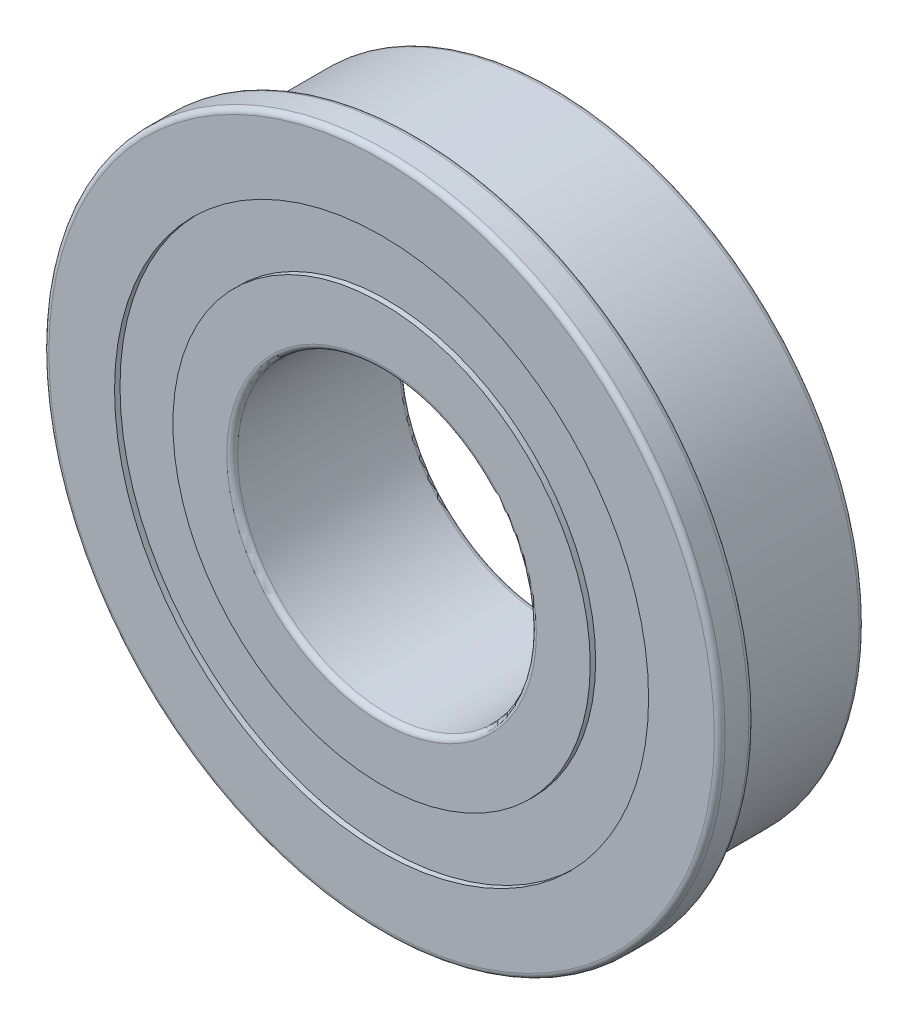
ISO-10303-21;
HEADER;
FILE_DESCRIPTION(('STEP AP214'),'2;1');
FILE_NAME('part.step','',(''),(''),'','','');
FILE_SCHEMA(('AUTOMOTIVE_DESIGN { 1 0 10303 214 1 1 1 1 }'));
ENDSEC;
DATA;
#1=APPLICATION_CONTEXT('core data for automotive mechanical design processes');
#2=APPLICATION_PROTOCOL_DEFINITION('international standard','automotive_design',2000,#1);
#3=PRODUCT_CONTEXT('',#1,'mechanical');
#4=PRODUCT('Part','Part','',(#3));
#5=PRODUCT_RELATED_PRODUCT_CATEGORY('part','',(#4));
#6=PRODUCT_DEFINITION_FORMATION('','',#4);
#7=PRODUCT_DEFINITION_CONTEXT('part definition',#1,'design');
#8=PRODUCT_DEFINITION('design','',#6,#7);
#9=PRODUCT_DEFINITION_SHAPE('','',#8);
#10=(LENGTH_UNIT() NAMED_UNIT(*) SI_UNIT(.MILLI.,.METRE.));
#11=(NAMED_UNIT(*) PLANE_ANGLE_UNIT() SI_UNIT($,.RADIAN.));
#12=(NAMED_UNIT(*) SI_UNIT($,.STERADIAN.) SOLID_ANGLE_UNIT());
#13=UNCERTAINTY_MEASURE_WITH_UNIT(LENGTH_MEASURE(1.E-05),#10,'distance_accuracy_value','');
#14=(GEOMETRIC_REPRESENTATION_CONTEXT(3) GLOBAL_UNCERTAINTY_ASSIGNED_CONTEXT((#13)) GLOBAL_UNIT_ASSIGNED_CONTEXT((#10,
#11,#12)) REPRESENTATION_CONTEXT('',''));
#15=CARTESIAN_POINT('',(0.,0.,0.));
#16=DIRECTION('',(0.,0.,1.));
#17=DIRECTION('',(1.,0.,0.));
#18=AXIS2_PLACEMENT_3D('',#15,#16,#17);
#19=CARTESIAN_POINT('',(0.,0.,53.2489151398));
#20=DIRECTION('',(0.,0.,1.));
#21=DIRECTION('',(1.,0.,0.));
#22=AXIS2_PLACEMENT_3D('',#19,#20,#21);
#23=CYLINDRICAL_SURFACE('',#22,12.2875);
#24=CARTESIAN_POINT('',(0.,0.,-3.96875));
#25=DIRECTION('',(0.,0.,1.));
#26=DIRECTION('',(1.,0.,0.));
#27=AXIS2_PLACEMENT_3D('',#24,#25,#26);
#28=CIRCLE('',#27,12.2875);
#29=CARTESIAN_POINT('',(12.2875,0.,-3.96875));
#30=VERTEX_POINT('',#29);
#31=EDGE_CURVE('E394',#30,#30,#28,.F.);
#32=ORIENTED_EDGE('',*,*,#31,.T.);
#33=EDGE_LOOP('',(#32));
#34=FACE_BOUND('',#33,.T.);
#35=CARTESIAN_POINT('',(0.,0.,-3.71875));
#36=DIRECTION('',(0.,0.,1.));
#37=DIRECTION('',(1.,0.,0.));
#38=AXIS2_PLACEMENT_3D('',#35,#36,#37);
#39=CIRCLE('',#38,12.2875);
#40=CARTESIAN_POINT('',(12.2875,0.,-3.71875));
#41=VERTEX_POINT('',#40);
#42=EDGE_CURVE('E80',#41,#41,#39,.T.);
#43=ORIENTED_EDGE('',*,*,#42,.T.);
#44=EDGE_LOOP('',(#43));
#45=FACE_BOUND('',#44,.T.);
#46=ADVANCED_FACE('F17',(#34,#45),#23,.F.);
#47=CARTESIAN_POINT('',(0.,12.2875,-3.96875));
#48=DIRECTION('',(0.,0.,1.));
#49=DIRECTION('',(1.,0.,0.));
#50=AXIS2_PLACEMENT_3D('',#47,#48,#49);
#51=PLANE('',#50);
#52=ORIENTED_EDGE('',*,*,#31,.F.);
#53=EDGE_LOOP('',(#52));
#54=FACE_BOUND('',#53,.T.);
#55=CARTESIAN_POINT('',(0.,0.,-3.96875));
#56=DIRECTION('',(0.,0.,1.));
#57=DIRECTION('',(1.,0.,0.));
#58=AXIS2_PLACEMENT_3D('',#55,#56,#57);
#59=CIRCLE('',#58,14.0375);
#60=CARTESIAN_POINT('',(14.0375,0.,-3.96875));
#61=VERTEX_POINT('',#60);
#62=CARTESIAN_POINT('',(-14.0375,0.,-3.96875));
#63=VERTEX_POINT('',#62);
#64=EDGE_CURVE('E70',#61,#63,#59,.T.);
#65=ORIENTED_EDGE('',*,*,#64,.F.);
#66=CARTESIAN_POINT('',(0.,0.,-3.96875));
#67=DIRECTION('',(0.,0.,1.));
#68=DIRECTION('',(-1.,0.,0.));
#69=AXIS2_PLACEMENT_3D('',#66,#67,#68);
#70=CIRCLE('',#69,14.0375);
#71=EDGE_CURVE('E68',#63,#61,#70,.T.);
#72=ORIENTED_EDGE('',*,*,#71,.F.);
#73=EDGE_LOOP('',(#65,#72));
#74=FACE_BOUND('',#73,.T.);
#75=ADVANCED_FACE('F79',(#54,#74),#51,.F.);
#76=CARTESIAN_POINT('',(0.,9.602,-3.71875));
#77=DIRECTION('',(0.,0.,1.));
#78=DIRECTION('',(1.,0.,0.));
#79=AXIS2_PLACEMENT_3D('',#76,#77,#78);
#80=PLANE('',#79);
#81=CARTESIAN_POINT('',(0.,0.,-3.71874999978));
#82=DIRECTION('',(0.,0.,1.));
#83=DIRECTION('',(1.,0.,0.));
#84=AXIS2_PLACEMENT_3D('',#81,#82,#83);
#85=CIRCLE('',#84,9.602);
#86=CARTESIAN_POINT('',(9.602,0.,-3.71874999978));
#87=VERTEX_POINT('',#86);
#88=EDGE_CURVE('E75',#87,#87,#85,.F.);
#89=ORIENTED_EDGE('',*,*,#88,.F.);
#90=EDGE_LOOP('',(#89));
#91=FACE_BOUND('',#90,.T.);
#92=ORIENTED_EDGE('',*,*,#42,.F.);
#93=EDGE_LOOP('',(#92));
#94=FACE_BOUND('',#93,.T.);
#95=ADVANCED_FACE('F94',(#91,#94),#80,.F.);
#96=CARTESIAN_POINT('',(0.,0.,-3.71875));
#97=DIRECTION('',(0.,0.,1.));
#98=DIRECTION('',(1.,0.,0.));
#99=AXIS2_PLACEMENT_3D('',#96,#97,#98);
#100=TOROIDAL_SURFACE('',#99,14.0375,0.25);
#101=CARTESIAN_POINT('',(0.,0.,-3.71875));
#102=DIRECTION('',(0.,0.,1.));
#103=DIRECTION('',(1.,0.,0.));
#104=AXIS2_PLACEMENT_3D('',#101,#102,#103);
#105=CIRCLE('',#104,14.2875);
#106=CARTESIAN_POINT('',(14.2875,0.,-3.71875));
#107=VERTEX_POINT('',#106);
#108=EDGE_CURVE('E109',#107,#107,#105,.T.);
#109=ORIENTED_EDGE('',*,*,#108,.F.);
#110=EDGE_LOOP('',(#109));
#111=FACE_BOUND('',#110,.T.);
#112=ORIENTED_EDGE('',*,*,#64,.T.);
#113=ORIENTED_EDGE('',*,*,#71,.T.);
#114=EDGE_LOOP('',(#112,#113));
#115=FACE_BOUND('',#114,.T.);
#116=ADVANCED_FACE('F72',(#111,#115),#100,.T.);
#117=CARTESIAN_POINT('',(0.,0.,53.2489151398));
#118=DIRECTION('',(0.,0.,1.));
#119=DIRECTION('',(1.,0.,0.));
#120=AXIS2_PLACEMENT_3D('',#117,#118,#119);
#121=CYLINDRICAL_SURFACE('',#120,9.602);
#122=ORIENTED_EDGE('',*,*,#88,.T.);
#123=EDGE_LOOP('',(#122));
#124=FACE_BOUND('',#123,.T.);
#125=CARTESIAN_POINT('',(0.,0.,-3.96874999978));
#126=DIRECTION('',(0.,0.,1.));
#127=DIRECTION('',(1.,0.,0.));
#128=AXIS2_PLACEMENT_3D('',#125,#126,#127);
#129=CIRCLE('',#128,9.602);
#130=CARTESIAN_POINT('',(9.602,0.,-3.96874999978));
#131=VERTEX_POINT('',#130);
#132=EDGE_CURVE('E112',#131,#131,#129,.T.);
#133=ORIENTED_EDGE('',*,*,#132,.T.);
#134=EDGE_LOOP('',(#133));
#135=FACE_BOUND('',#134,.T.);
#136=ADVANCED_FACE('F103',(#124,#135),#121,.T.);
#137=CARTESIAN_POINT('',(0.,0.,53.2489151398));
#138=DIRECTION('',(0.,0.,1.));
#139=DIRECTION('',(1.,0.,0.));
#140=AXIS2_PLACEMENT_3D('',#137,#138,#139);
#141=CYLINDRICAL_SURFACE('',#140,14.2875);
#142=CARTESIAN_POINT('',(0.,0.,1.63125));
#143=DIRECTION('',(0.,0.,-1.));
#144=DIRECTION('',(-1.,0.,0.));
#145=AXIS2_PLACEMENT_3D('',#142,#143,#144);
#146=CIRCLE('',#145,14.2875);
#147=CARTESIAN_POINT('',(-14.2875,0.,1.63125));
#148=VERTEX_POINT('',#147);
#149=EDGE_CURVE('E113',#148,#148,#146,.F.);
#150=ORIENTED_EDGE('',*,*,#149,.F.);
#151=EDGE_LOOP('',(#150));
#152=FACE_BOUND('',#151,.T.);
#153=ORIENTED_EDGE('',*,*,#108,.T.);
#154=EDGE_LOOP('',(#153));
#155=FACE_BOUND('',#154,.T.);
#156=ADVANCED_FACE('F163',(#152,#155),#141,.T.);
#157=CARTESIAN_POINT('',(0.,6.875,-3.96875));
#158=DIRECTION('',(0.,0.,1.));
#159=DIRECTION('',(1.,0.,0.));
#160=AXIS2_PLACEMENT_3D('',#157,#158,#159);
#161=PLANE('',#160);
#162=CARTESIAN_POINT('',(0.,0.,-3.96875));
#163=DIRECTION('',(0.,0.,-1.));
#164=DIRECTION('',(1.,0.,0.));
#165=AXIS2_PLACEMENT_3D('',#162,#163,#164);
#166=CIRCLE('',#165,7.125);
#167=CARTESIAN_POINT('',(7.125,0.,-3.96875));
#168=VERTEX_POINT('',#167);
#169=CARTESIAN_POINT('',(-7.125,0.,-3.96875));
#170=VERTEX_POINT('',#169);
#171=EDGE_CURVE('E116',#168,#170,#166,.T.);
#172=ORIENTED_EDGE('',*,*,#171,.F.);
#173=CARTESIAN_POINT('',(0.,0.,-3.96875));
#174=DIRECTION('',(0.,0.,-1.));
#175=DIRECTION('',(-1.,0.,0.));
#176=AXIS2_PLACEMENT_3D('',#173,#174,#175);
#177=CIRCLE('',#176,7.125);
#178=EDGE_CURVE('E147',#170,#168,#177,.T.);
#179=ORIENTED_EDGE('',*,*,#178,.F.);
#180=EDGE_LOOP('',(#172,#179));
#181=FACE_BOUND('',#180,.T.);
#182=ORIENTED_EDGE('',*,*,#132,.F.);
#183=EDGE_LOOP('',(#182));
#184=FACE_BOUND('',#183,.T.);
#185=ADVANCED_FACE('F155',(#181,#184),#161,.F.);
#186=CARTESIAN_POINT('',(0.,0.,1.63125));
#187=DIRECTION('',(0.,0.,-1.));
#188=DIRECTION('',(0.,1.,0.));
#189=AXIS2_PLACEMENT_3D('',#186,#187,#188);
#190=CONICAL_SURFACE('',#189,14.2875,0.523598775597999);
#191=ORIENTED_EDGE('',*,*,#149,.T.);
#192=EDGE_LOOP('',(#191));
#193=FACE_BOUND('',#192,.T.);
#194=CARTESIAN_POINT('',(0.,0.,2.00624999998003));
#195=DIRECTION('',(0.,0.,1.));
#196=DIRECTION('',(1.,0.,0.));
#197=AXIS2_PLACEMENT_3D('',#194,#195,#196);
#198=CIRCLE('',#197,14.0709936490654);
#199=CARTESIAN_POINT('',(14.0709936490654,0.,2.00624999998003));
#200=VERTEX_POINT('',#199);
#201=EDGE_CURVE('E144',#200,#200,#198,.F.);
#202=ORIENTED_EDGE('',*,*,#201,.T.);
#203=EDGE_LOOP('',(#202));
#204=FACE_BOUND('',#203,.T.);
#205=ADVANCED_FACE('F134',(#193,#204),#190,.T.);
#206=CARTESIAN_POINT('',(0.,0.,-3.71875));
#207=DIRECTION('',(0.,0.,1.));
#208=DIRECTION('',(1.,0.,0.));
#209=AXIS2_PLACEMENT_3D('',#206,#207,#208);
#210=TOROIDAL_SURFACE('',#209,7.125,0.25);
#211=ORIENTED_EDGE('',*,*,#171,.T.);
#212=ORIENTED_EDGE('',*,*,#178,.T.);
#213=EDGE_LOOP('',(#211,#212));
#214=FACE_BOUND('',#213,.T.);
#215=CARTESIAN_POINT('',(0.,0.,-3.71875));
#216=DIRECTION('',(0.,0.,1.));
#217=DIRECTION('',(1.,0.,0.));
#218=AXIS2_PLACEMENT_3D('',#215,#216,#217);
#219=CIRCLE('',#218,6.875);
#220=CARTESIAN_POINT('',(6.875,0.,-3.71875));
#221=VERTEX_POINT('',#220);
#222=EDGE_CURVE('E142',#221,#221,#219,.T.);
#223=ORIENTED_EDGE('',*,*,#222,.T.);
#224=EDGE_LOOP('',(#223));
#225=FACE_BOUND('',#224,.T.);
#226=ADVANCED_FACE('F122',(#214,#225),#210,.T.);
#227=CARTESIAN_POINT('',(0.,0.,53.2489151398));
#228=DIRECTION('',(0.,0.,1.));
#229=DIRECTION('',(1.,0.,0.));
#230=AXIS2_PLACEMENT_3D('',#227,#228,#229);
#231=CYLINDRICAL_SURFACE('',#230,6.875);
#232=ORIENTED_EDGE('',*,*,#222,.F.);
#233=EDGE_LOOP('',(#232));
#234=FACE_BOUND('',#233,.T.);
#235=CARTESIAN_POINT('',(0.,0.,3.71875));
#236=DIRECTION('',(0.,0.,-1.));
#237=DIRECTION('',(-1.,0.,0.));
#238=AXIS2_PLACEMENT_3D('',#235,#236,#237);
#239=CIRCLE('',#238,6.875);
#240=CARTESIAN_POINT('',(-6.875,0.,3.71875));
#241=VERTEX_POINT('',#240);
#242=EDGE_CURVE('E555',#241,#241,#239,.T.);
#243=ORIENTED_EDGE('',*,*,#242,.F.);
#244=EDGE_LOOP('',(#243));
#245=FACE_BOUND('',#244,.T.);
#246=ADVANCED_FACE('F133',(#234,#245),#231,.F.);
#247=CARTESIAN_POINT('',(0.,0.,2.13125));
#248=DIRECTION('',(0.,0.,1.));
#249=DIRECTION('',(1.,0.,0.));
#250=AXIS2_PLACEMENT_3D('',#247,#248,#249);
#251=TOROIDAL_SURFACE('',#250,14.2875,0.25);
#252=ORIENTED_EDGE('',*,*,#201,.F.);
#253=EDGE_LOOP('',(#252));
#254=FACE_BOUND('',#253,.T.);
#255=CARTESIAN_POINT('',(0.,0.,2.38125));
#256=DIRECTION('',(0.,0.,-1.));
#257=DIRECTION('',(1.,0.,0.));
#258=AXIS2_PLACEMENT_3D('',#255,#256,#257);
#259=CIRCLE('',#258,14.2875);
#260=CARTESIAN_POINT('',(14.2875,0.,2.38125));
#261=VERTEX_POINT('',#260);
#262=CARTESIAN_POINT('',(-14.2875,0.,2.38125));
#263=VERTEX_POINT('',#262);
#264=EDGE_CURVE('E553',#261,#263,#259,.T.);
#265=ORIENTED_EDGE('',*,*,#264,.T.);
#266=CARTESIAN_POINT('',(0.,0.,2.38125));
#267=DIRECTION('',(0.,0.,-1.));
#268=DIRECTION('',(-1.,0.,0.));
#269=AXIS2_PLACEMENT_3D('',#266,#267,#268);
#270=CIRCLE('',#269,14.2875);
#271=EDGE_CURVE('E323',#263,#261,#270,.T.);
#272=ORIENTED_EDGE('',*,*,#271,.T.);
#273=EDGE_LOOP('',(#265,#272));
#274=FACE_BOUND('',#273,.T.);
#275=ADVANCED_FACE('F356',(#254,#274),#251,.F.);
#276=CARTESIAN_POINT('',(0.,0.,3.71875));
#277=DIRECTION('',(0.,0.,-1.));
#278=DIRECTION('',(-1.,0.,0.));
#279=AXIS2_PLACEMENT_3D('',#276,#277,#278);
#280=TOROIDAL_SURFACE('',#279,7.125,0.25);
#281=CARTESIAN_POINT('',(0.,0.,3.96875));
#282=DIRECTION('',(0.,0.,1.));
#283=DIRECTION('',(-1.,0.,0.));
#284=AXIS2_PLACEMENT_3D('',#281,#282,#283);
#285=CIRCLE('',#284,7.125);
#286=CARTESIAN_POINT('',(-7.125,0.,3.96875));
#287=VERTEX_POINT('',#286);
#288=CARTESIAN_POINT('',(7.125,0.,3.96875));
#289=VERTEX_POINT('',#288);
#290=EDGE_CURVE('E267',#287,#289,#285,.T.);
#291=ORIENTED_EDGE('',*,*,#290,.T.);
#292=CARTESIAN_POINT('',(0.,0.,3.96875));
#293=DIRECTION('',(0.,0.,1.));
#294=DIRECTION('',(1.,0.,0.));
#295=AXIS2_PLACEMENT_3D('',#292,#293,#294);
#296=CIRCLE('',#295,7.125);
#297=EDGE_CURVE('E278',#289,#287,#296,.T.);
#298=ORIENTED_EDGE('',*,*,#297,.T.);
#299=EDGE_LOOP('',(#291,#298));
#300=FACE_BOUND('',#299,.T.);
#301=ORIENTED_EDGE('',*,*,#242,.T.);
#302=EDGE_LOOP('',(#301));
#303=FACE_BOUND('',#302,.T.);
#304=ADVANCED_FACE('F302',(#300,#303),#280,.T.);
#305=CARTESIAN_POINT('',(0.,14.2875,2.38125));
#306=DIRECTION('',(0.,0.,1.));
#307=DIRECTION('',(1.,0.,0.));
#308=AXIS2_PLACEMENT_3D('',#305,#306,#307);
#309=PLANE('',#308);
#310=ORIENTED_EDGE('',*,*,#264,.F.);
#311=ORIENTED_EDGE('',*,*,#271,.F.);
#312=EDGE_LOOP('',(#310,#311));
#313=FACE_BOUND('',#312,.T.);
#314=CARTESIAN_POINT('',(0.,0.,2.38125));
#315=DIRECTION('',(0.,0.,1.));
#316=DIRECTION('',(1.,0.,0.));
#317=AXIS2_PLACEMENT_3D('',#314,#315,#316);
#318=CIRCLE('',#317,15.31);
#319=CARTESIAN_POINT('',(15.31,0.,2.38125));
#320=VERTEX_POINT('',#319);
#321=CARTESIAN_POINT('',(-15.31,0.,2.38125));
#322=VERTEX_POINT('',#321);
#323=EDGE_CURVE('E236',#320,#322,#318,.T.);
#324=ORIENTED_EDGE('',*,*,#323,.F.);
#325=CARTESIAN_POINT('',(0.,0.,2.38125));
#326=DIRECTION('',(0.,0.,1.));
#327=DIRECTION('',(-1.,0.,0.));
#328=AXIS2_PLACEMENT_3D('',#325,#326,#327);
#329=CIRCLE('',#328,15.31);
#330=EDGE_CURVE('E333',#322,#320,#329,.T.);
#331=ORIENTED_EDGE('',*,*,#330,.F.);
#332=EDGE_LOOP('',(#324,#331));
#333=FACE_BOUND('',#332,.T.);
#334=ADVANCED_FACE('F293',(#313,#333),#309,.F.);
#335=CARTESIAN_POINT('',(0.,9.602,3.96875));
#336=DIRECTION('',(0.,0.,-1.));
#337=DIRECTION('',(-1.,0.,0.));
#338=AXIS2_PLACEMENT_3D('',#335,#336,#337);
#339=PLANE('',#338);
#340=ORIENTED_EDGE('',*,*,#290,.F.);
#341=ORIENTED_EDGE('',*,*,#297,.F.);
#342=EDGE_LOOP('',(#340,#341));
#343=FACE_BOUND('',#342,.T.);
#344=CARTESIAN_POINT('',(0.,0.,3.96875000022));
#345=DIRECTION('',(0.,0.,1.));
#346=DIRECTION('',(1.,0.,0.));
#347=AXIS2_PLACEMENT_3D('',#344,#345,#346);
#348=CIRCLE('',#347,9.602);
#349=CARTESIAN_POINT('',(9.602,0.,3.96875000022));
#350=VERTEX_POINT('',#349);
#351=EDGE_CURVE('E389',#350,#350,#348,.F.);
#352=ORIENTED_EDGE('',*,*,#351,.F.);
#353=EDGE_LOOP('',(#352));
#354=FACE_BOUND('',#353,.T.);
#355=ADVANCED_FACE('F256',(#343,#354),#339,.F.);
#356=CARTESIAN_POINT('',(0.,0.,2.63125));
#357=DIRECTION('',(0.,0.,1.));
#358=DIRECTION('',(-1.,0.,0.));
#359=AXIS2_PLACEMENT_3D('',#356,#357,#358);
#360=TOROIDAL_SURFACE('',#359,15.31,0.25);
#361=ORIENTED_EDGE('',*,*,#323,.T.);
#362=ORIENTED_EDGE('',*,*,#330,.T.);
#363=EDGE_LOOP('',(#361,#362));
#364=FACE_BOUND('',#363,.T.);
#365=CARTESIAN_POINT('',(0.,0.,2.63125));
#366=DIRECTION('',(0.,0.,1.));
#367=DIRECTION('',(1.,0.,0.));
#368=AXIS2_PLACEMENT_3D('',#365,#366,#367);
#369=CIRCLE('',#368,15.56);
#370=CARTESIAN_POINT('',(15.56,0.,2.63125));
#371=VERTEX_POINT('',#370);
#372=EDGE_CURVE('E264',#371,#371,#369,.T.);
#373=ORIENTED_EDGE('',*,*,#372,.F.);
#374=EDGE_LOOP('',(#373));
#375=FACE_BOUND('',#374,.T.);
#376=ADVANCED_FACE('F244',(#364,#375),#360,.T.);
#377=CARTESIAN_POINT('',(0.,0.,53.2489151398));
#378=DIRECTION('',(0.,0.,1.));
#379=DIRECTION('',(1.,0.,0.));
#380=AXIS2_PLACEMENT_3D('',#377,#378,#379);
#381=CYLINDRICAL_SURFACE('',#380,9.602);
#382=ORIENTED_EDGE('',*,*,#351,.T.);
#383=EDGE_LOOP('',(#382));
#384=FACE_BOUND('',#383,.T.);
#385=CARTESIAN_POINT('',(0.,0.,3.71875000022));
#386=DIRECTION('',(0.,0.,1.));
#387=DIRECTION('',(1.,0.,0.));
#388=AXIS2_PLACEMENT_3D('',#385,#386,#387);
#389=CIRCLE('',#388,9.602);
#390=CARTESIAN_POINT('',(9.602,0.,3.71875000022));
#391=VERTEX_POINT('',#390);
#392=EDGE_CURVE('E540',#391,#391,#389,.T.);
#393=ORIENTED_EDGE('',*,*,#392,.T.);
#394=EDGE_LOOP('',(#393));
#395=FACE_BOUND('',#394,.T.);
#396=ADVANCED_FACE('F255',(#384,#395),#381,.T.);
#397=CARTESIAN_POINT('',(0.,0.,53.2489151398));
#398=DIRECTION('',(0.,0.,1.));
#399=DIRECTION('',(1.,0.,0.));
#400=AXIS2_PLACEMENT_3D('',#397,#398,#399);
#401=CYLINDRICAL_SURFACE('',#400,15.56);
#402=ORIENTED_EDGE('',*,*,#372,.T.);
#403=EDGE_LOOP('',(#402));
#404=FACE_BOUND('',#403,.T.);
#405=CARTESIAN_POINT('',(0.,0.,3.71875));
#406=DIRECTION('',(0.,0.,-1.));
#407=DIRECTION('',(1.,0.,0.));
#408=AXIS2_PLACEMENT_3D('',#405,#406,#407);
#409=CIRCLE('',#408,15.56);
#410=CARTESIAN_POINT('',(15.56,0.,3.71875));
#411=VERTEX_POINT('',#410);
#412=EDGE_CURVE('E545',#411,#411,#409,.F.);
#413=ORIENTED_EDGE('',*,*,#412,.F.);
#414=EDGE_LOOP('',(#413));
#415=FACE_BOUND('',#414,.T.);
#416=ADVANCED_FACE('F499',(#404,#415),#401,.T.);
#417=CARTESIAN_POINT('',(0.,12.2875,3.71875));
#418=DIRECTION('',(0.,0.,-1.));
#419=DIRECTION('',(-1.,0.,0.));
#420=AXIS2_PLACEMENT_3D('',#417,#418,#419);
#421=PLANE('',#420);
#422=ORIENTED_EDGE('',*,*,#392,.F.);
#423=EDGE_LOOP('',(#422));
#424=FACE_BOUND('',#423,.T.);
#425=CARTESIAN_POINT('',(0.,0.,3.71875000022));
#426=DIRECTION('',(0.,0.,1.));
#427=DIRECTION('',(1.,0.,0.));
#428=AXIS2_PLACEMENT_3D('',#425,#426,#427);
#429=CIRCLE('',#428,12.2875);
#430=CARTESIAN_POINT('',(12.2875,0.,3.71875000022));
#431=VERTEX_POINT('',#430);
#432=EDGE_CURVE('E543',#431,#431,#429,.T.);
#433=ORIENTED_EDGE('',*,*,#432,.T.);
#434=EDGE_LOOP('',(#433));
#435=FACE_BOUND('',#434,.T.);
#436=ADVANCED_FACE('F215',(#424,#435),#421,.F.);
#437=CARTESIAN_POINT('',(0.,0.,3.71875));
#438=DIRECTION('',(0.,0.,-1.));
#439=DIRECTION('',(1.,0.,0.));
#440=AXIS2_PLACEMENT_3D('',#437,#438,#439);
#441=TOROIDAL_SURFACE('',#440,15.31,0.25);
#442=CARTESIAN_POINT('',(0.,0.,3.96875));
#443=DIRECTION('',(0.,0.,-1.));
#444=DIRECTION('',(-1.,0.,0.));
#445=AXIS2_PLACEMENT_3D('',#442,#443,#444);
#446=CIRCLE('',#445,15.31);
#447=CARTESIAN_POINT('',(-15.31,0.,3.96875));
#448=VERTEX_POINT('',#447);
#449=CARTESIAN_POINT('',(15.31,0.,3.96875));
#450=VERTEX_POINT('',#449);
#451=EDGE_CURVE('E544',#448,#450,#446,.T.);
#452=ORIENTED_EDGE('',*,*,#451,.T.);
#453=CARTESIAN_POINT('',(0.,0.,3.96875));
#454=DIRECTION('',(0.,0.,-1.));
#455=DIRECTION('',(1.,0.,0.));
#456=AXIS2_PLACEMENT_3D('',#453,#454,#455);
#457=CIRCLE('',#456,15.31);
#458=EDGE_CURVE('E28',#450,#448,#457,.T.);
#459=ORIENTED_EDGE('',*,*,#458,.T.);
#460=EDGE_LOOP('',(#452,#459));
#461=FACE_BOUND('',#460,.T.);
#462=ORIENTED_EDGE('',*,*,#412,.T.);
#463=EDGE_LOOP('',(#462));
#464=FACE_BOUND('',#463,.T.);
#465=ADVANCED_FACE('F189',(#461,#464),#441,.T.);
#466=CARTESIAN_POINT('',(0.,0.,53.2489151398));
#467=DIRECTION('',(0.,0.,1.));
#468=DIRECTION('',(1.,0.,0.));
#469=AXIS2_PLACEMENT_3D('',#466,#467,#468);
#470=CYLINDRICAL_SURFACE('',#469,12.2875);
#471=ORIENTED_EDGE('',*,*,#432,.F.);
#472=EDGE_LOOP('',(#471));
#473=FACE_BOUND('',#472,.T.);
#474=CARTESIAN_POINT('',(0.,0.,3.96875000022));
#475=DIRECTION('',(0.,0.,1.));
#476=DIRECTION('',(1.,0.,0.));
#477=AXIS2_PLACEMENT_3D('',#474,#475,#476);
#478=CIRCLE('',#477,12.2875);
#479=CARTESIAN_POINT('',(12.2875,0.,3.96875000022));
#480=VERTEX_POINT('',#479);
#481=EDGE_CURVE('E11',#480,#480,#478,.T.);
#482=ORIENTED_EDGE('',*,*,#481,.T.);
#483=EDGE_LOOP('',(#482));
#484=FACE_BOUND('',#483,.T.);
#485=ADVANCED_FACE('F183',(#473,#484),#470,.F.);
#486=CARTESIAN_POINT('',(0.,15.56,3.96875));
#487=DIRECTION('',(0.,0.,-1.));
#488=DIRECTION('',(-1.,0.,0.));
#489=AXIS2_PLACEMENT_3D('',#486,#487,#488);
#490=PLANE('',#489);
#491=ORIENTED_EDGE('',*,*,#481,.F.);
#492=EDGE_LOOP('',(#491));
#493=FACE_BOUND('',#492,.T.);
#494=ORIENTED_EDGE('',*,*,#451,.F.);
#495=ORIENTED_EDGE('',*,*,#458,.F.);
#496=EDGE_LOOP('',(#494,#495));
#497=FACE_BOUND('',#496,.T.);
#498=ADVANCED_FACE('F181',(#493,#497),#490,.F.);
#499=CLOSED_SHELL('',(#46,#75,#95,#116,#136,#156,#185,#205,#226,#246,#275,#304,#334,#355,#376,
#396,#416,#436,#465,#485,#498));
#500=MANIFOLD_SOLID_BREP('B1',#499);
#501=ADVANCED_BREP_SHAPE_REPRESENTATION('',(#18,#500),#14);
#502=SHAPE_DEFINITION_REPRESENTATION(#9,#501);
ENDSEC;
END-ISO-10303-21;
